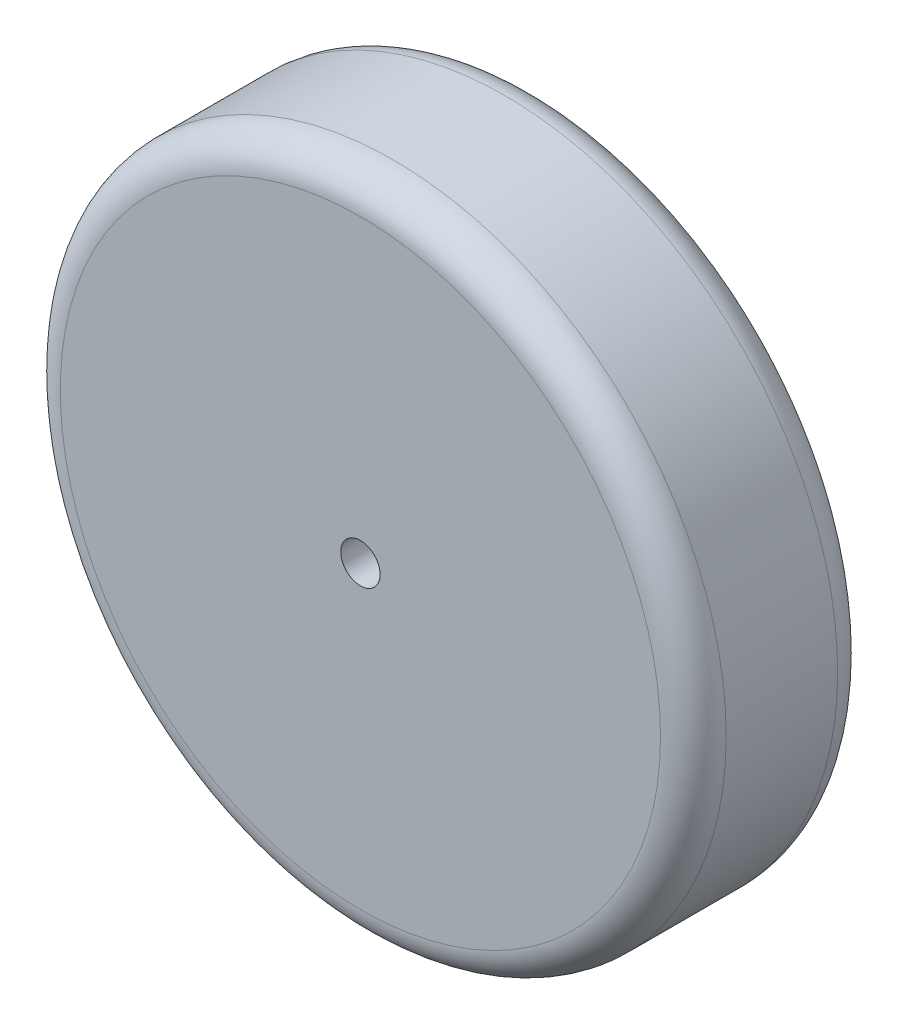
ISO-10303-21;
HEADER;
FILE_DESCRIPTION(('STEP AP214'),'2;1');
FILE_NAME('part.step','',(''),(''),'','','');
FILE_SCHEMA(('AUTOMOTIVE_DESIGN { 1 0 10303 214 1 1 1 1 }'));
ENDSEC;
DATA;
#1=APPLICATION_CONTEXT('core data for automotive mechanical design processes');
#2=APPLICATION_PROTOCOL_DEFINITION('international standard','automotive_design',2000,#1);
#3=PRODUCT_CONTEXT('',#1,'mechanical');
#4=PRODUCT('Part','Part','',(#3));
#5=PRODUCT_RELATED_PRODUCT_CATEGORY('part','',(#4));
#6=PRODUCT_DEFINITION_FORMATION('','',#4);
#7=PRODUCT_DEFINITION_CONTEXT('part definition',#1,'design');
#8=PRODUCT_DEFINITION('design','',#6,#7);
#9=PRODUCT_DEFINITION_SHAPE('','',#8);
#10=(LENGTH_UNIT() NAMED_UNIT(*) SI_UNIT(.MILLI.,.METRE.));
#11=(NAMED_UNIT(*) PLANE_ANGLE_UNIT() SI_UNIT($,.RADIAN.));
#12=(NAMED_UNIT(*) SI_UNIT($,.STERADIAN.) SOLID_ANGLE_UNIT());
#13=UNCERTAINTY_MEASURE_WITH_UNIT(LENGTH_MEASURE(1.E-05),#10,'distance_accuracy_value','');
#14=(GEOMETRIC_REPRESENTATION_CONTEXT(3) GLOBAL_UNCERTAINTY_ASSIGNED_CONTEXT((#13)) GLOBAL_UNIT_ASSIGNED_CONTEXT((#10,
#11,#12)) REPRESENTATION_CONTEXT('',''));
#15=CARTESIAN_POINT('',(0.,0.,0.));
#16=DIRECTION('',(0.,0.,1.));
#17=DIRECTION('',(1.,0.,0.));
#18=AXIS2_PLACEMENT_3D('',#15,#16,#17);
#19=CARTESIAN_POINT('',(0.,0.,54.));
#20=DIRECTION('',(0.,0.,-1.));
#21=DIRECTION('',(-1.,0.,0.));
#22=AXIS2_PLACEMENT_3D('',#19,#20,#21);
#23=CYLINDRICAL_SURFACE('',#22,101.5);
#24=CARTESIAN_POINT('',(0.,0.,10.));
#25=DIRECTION('',(0.,0.,1.));
#26=DIRECTION('',(1.,0.,0.));
#27=AXIS2_PLACEMENT_3D('',#24,#25,#26);
#28=CIRCLE('',#27,101.5);
#29=CARTESIAN_POINT('',(101.5,0.,10.));
#30=VERTEX_POINT('',#29);
#31=EDGE_CURVE('E43',#30,#30,#28,.T.);
#32=ORIENTED_EDGE('',*,*,#31,.T.);
#33=EDGE_LOOP('',(#32));
#34=FACE_BOUND('',#33,.T.);
#35=CARTESIAN_POINT('',(0.,0.,44.));
#36=DIRECTION('',(0.,0.,1.));
#37=DIRECTION('',(1.,0.,0.));
#38=AXIS2_PLACEMENT_3D('',#35,#36,#37);
#39=CIRCLE('',#38,101.5);
#40=CARTESIAN_POINT('',(101.5,0.,44.));
#41=VERTEX_POINT('',#40);
#42=EDGE_CURVE('E47',#41,#41,#39,.F.);
#43=ORIENTED_EDGE('',*,*,#42,.T.);
#44=EDGE_LOOP('',(#43));
#45=FACE_BOUND('',#44,.T.);
#46=ADVANCED_FACE('F32',(#34,#45),#23,.T.);
#47=CARTESIAN_POINT('',(0.,0.,54.));
#48=DIRECTION('',(0.,0.,1.));
#49=DIRECTION('',(1.,0.,0.));
#50=AXIS2_PLACEMENT_3D('',#47,#48,#49);
#51=PLANE('',#50);
#52=CARTESIAN_POINT('',(0.,0.,54.));
#53=DIRECTION('',(0.,0.,-1.));
#54=DIRECTION('',(-1.,0.,0.));
#55=AXIS2_PLACEMENT_3D('',#52,#53,#54);
#56=CIRCLE('',#55,6.);
#57=CARTESIAN_POINT('',(-6.,0.,54.));
#58=VERTEX_POINT('',#57);
#59=EDGE_CURVE('E52',#58,#58,#56,.T.);
#60=ORIENTED_EDGE('',*,*,#59,.T.);
#61=EDGE_LOOP('',(#60));
#62=FACE_BOUND('',#61,.T.);
#63=CARTESIAN_POINT('',(0.,0.,54.));
#64=DIRECTION('',(0.,0.,1.));
#65=DIRECTION('',(1.,0.,0.));
#66=AXIS2_PLACEMENT_3D('',#63,#64,#65);
#67=CIRCLE('',#66,91.5);
#68=CARTESIAN_POINT('',(91.5,0.,54.));
#69=VERTEX_POINT('',#68);
#70=EDGE_CURVE('E10',#69,#69,#67,.T.);
#71=ORIENTED_EDGE('',*,*,#70,.T.);
#72=EDGE_LOOP('',(#71));
#73=FACE_BOUND('',#72,.T.);
#74=ADVANCED_FACE('F59',(#62,#73),#51,.T.);
#75=CARTESIAN_POINT('',(0.,0.,0.));
#76=DIRECTION('',(0.,0.,1.));
#77=DIRECTION('',(1.,0.,0.));
#78=AXIS2_PLACEMENT_3D('',#75,#76,#77);
#79=PLANE('',#78);
#80=CARTESIAN_POINT('',(0.,0.,0.));
#81=DIRECTION('',(0.,0.,-1.));
#82=DIRECTION('',(-1.,0.,0.));
#83=AXIS2_PLACEMENT_3D('',#80,#81,#82);
#84=CIRCLE('',#83,6.);
#85=CARTESIAN_POINT('',(-6.,0.,0.));
#86=VERTEX_POINT('',#85);
#87=EDGE_CURVE('E53',#86,#86,#84,.T.);
#88=ORIENTED_EDGE('',*,*,#87,.F.);
#89=EDGE_LOOP('',(#88));
#90=FACE_BOUND('',#89,.T.);
#91=CARTESIAN_POINT('',(0.,0.,0.));
#92=DIRECTION('',(0.,0.,1.));
#93=DIRECTION('',(1.,0.,0.));
#94=AXIS2_PLACEMENT_3D('',#91,#92,#93);
#95=CIRCLE('',#94,91.5);
#96=CARTESIAN_POINT('',(91.5,0.,0.));
#97=VERTEX_POINT('',#96);
#98=EDGE_CURVE('E39',#97,#97,#95,.F.);
#99=ORIENTED_EDGE('',*,*,#98,.T.);
#100=EDGE_LOOP('',(#99));
#101=FACE_BOUND('',#100,.T.);
#102=ADVANCED_FACE('F67',(#90,#101),#79,.F.);
#103=CARTESIAN_POINT('',(0.,0.,10.));
#104=DIRECTION('',(0.,0.,1.));
#105=DIRECTION('',(1.,0.,0.));
#106=AXIS2_PLACEMENT_3D('',#103,#104,#105);
#107=TOROIDAL_SURFACE('',#106,91.5,10.);
#108=ORIENTED_EDGE('',*,*,#98,.F.);
#109=EDGE_LOOP('',(#108));
#110=FACE_BOUND('',#109,.T.);
#111=ORIENTED_EDGE('',*,*,#31,.F.);
#112=EDGE_LOOP('',(#111));
#113=FACE_BOUND('',#112,.T.);
#114=ADVANCED_FACE('F69',(#110,#113),#107,.T.);
#115=CARTESIAN_POINT('',(0.,0.,44.));
#116=DIRECTION('',(0.,0.,1.));
#117=DIRECTION('',(1.,0.,0.));
#118=AXIS2_PLACEMENT_3D('',#115,#116,#117);
#119=TOROIDAL_SURFACE('',#118,91.5,10.);
#120=ORIENTED_EDGE('',*,*,#42,.F.);
#121=EDGE_LOOP('',(#120));
#122=FACE_BOUND('',#121,.T.);
#123=ORIENTED_EDGE('',*,*,#70,.F.);
#124=EDGE_LOOP('',(#123));
#125=FACE_BOUND('',#124,.T.);
#126=ADVANCED_FACE('F34',(#122,#125),#119,.T.);
#127=CARTESIAN_POINT('',(0.,0.,54.));
#128=DIRECTION('',(0.,0.,-1.));
#129=DIRECTION('',(-1.,0.,0.));
#130=AXIS2_PLACEMENT_3D('',#127,#128,#129);
#131=CYLINDRICAL_SURFACE('',#130,6.);
#132=ORIENTED_EDGE('',*,*,#59,.F.);
#133=EDGE_LOOP('',(#132));
#134=FACE_BOUND('',#133,.T.);
#135=ORIENTED_EDGE('',*,*,#87,.T.);
#136=EDGE_LOOP('',(#135));
#137=FACE_BOUND('',#136,.T.);
#138=ADVANCED_FACE('F61',(#134,#137),#131,.F.);
#139=CLOSED_SHELL('',(#46,#74,#102,#114,#126,#138));
#140=MANIFOLD_SOLID_BREP('B2',#139);
#141=ADVANCED_BREP_SHAPE_REPRESENTATION('',(#18,#140),#14);
#142=SHAPE_DEFINITION_REPRESENTATION(#9,#141);
ENDSEC;
END-ISO-10303-21;
